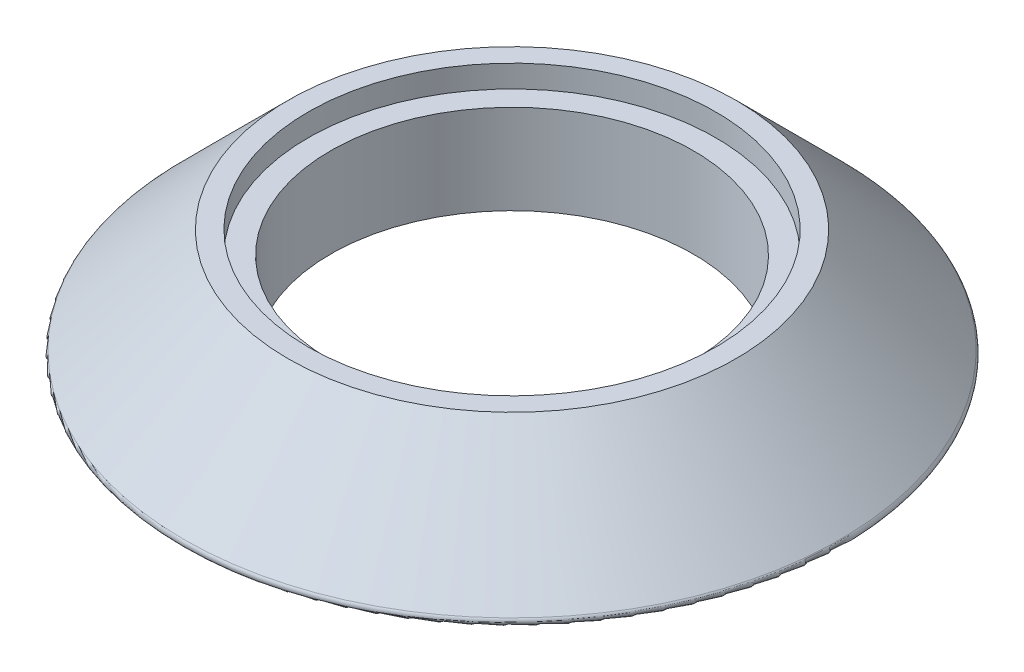
ISO-10303-21;
HEADER;
FILE_DESCRIPTION(('STEP AP214'),'2;1');
FILE_NAME('part.step','',(''),(''),'','','');
FILE_SCHEMA(('AUTOMOTIVE_DESIGN { 1 0 10303 214 1 1 1 1 }'));
ENDSEC;
DATA;
#1=APPLICATION_CONTEXT('core data for automotive mechanical design processes');
#2=APPLICATION_PROTOCOL_DEFINITION('international standard','automotive_design',2000,#1);
#3=PRODUCT_CONTEXT('',#1,'mechanical');
#4=PRODUCT('Part','Part','',(#3));
#5=PRODUCT_RELATED_PRODUCT_CATEGORY('part','',(#4));
#6=PRODUCT_DEFINITION_FORMATION('','',#4);
#7=PRODUCT_DEFINITION_CONTEXT('part definition',#1,'design');
#8=PRODUCT_DEFINITION('design','',#6,#7);
#9=PRODUCT_DEFINITION_SHAPE('','',#8);
#10=(LENGTH_UNIT() NAMED_UNIT(*) SI_UNIT(.MILLI.,.METRE.));
#11=(NAMED_UNIT(*) PLANE_ANGLE_UNIT() SI_UNIT($,.RADIAN.));
#12=(NAMED_UNIT(*) SI_UNIT($,.STERADIAN.) SOLID_ANGLE_UNIT());
#13=UNCERTAINTY_MEASURE_WITH_UNIT(LENGTH_MEASURE(1.E-05),#10,'distance_accuracy_value','');
#14=(GEOMETRIC_REPRESENTATION_CONTEXT(3) GLOBAL_UNCERTAINTY_ASSIGNED_CONTEXT((#13)) GLOBAL_UNIT_ASSIGNED_CONTEXT((#10,
#11,#12)) REPRESENTATION_CONTEXT('',''));
#15=CARTESIAN_POINT('',(0.,0.,0.));
#16=DIRECTION('',(0.,0.,1.));
#17=DIRECTION('',(1.,0.,0.));
#18=AXIS2_PLACEMENT_3D('',#15,#16,#17);
#19=CARTESIAN_POINT('',(0.,5.,0.));
#20=DIRECTION('',(0.,-1.,0.));
#21=DIRECTION('',(0.,0.,-1.));
#22=AXIS2_PLACEMENT_3D('',#19,#20,#21);
#23=CYLINDRICAL_SURFACE('',#22,8.1);
#24=CARTESIAN_POINT('',(0.,0.,0.));
#25=DIRECTION('',(0.,1.,0.));
#26=DIRECTION('',(0.,0.,1.));
#27=AXIS2_PLACEMENT_3D('',#24,#25,#26);
#28=CIRCLE('',#27,8.1);
#29=CARTESIAN_POINT('',(0.,0.,8.1));
#30=VERTEX_POINT('',#29);
#31=EDGE_CURVE('E42',#30,#30,#28,.T.);
#32=ORIENTED_EDGE('',*,*,#31,.F.);
#33=EDGE_LOOP('',(#32));
#34=FACE_BOUND('',#33,.T.);
#35=CARTESIAN_POINT('',(0.,4.,0.));
#36=DIRECTION('',(0.,1.,0.));
#37=DIRECTION('',(0.,0.,1.));
#38=AXIS2_PLACEMENT_3D('',#35,#36,#37);
#39=CIRCLE('',#38,8.1);
#40=CARTESIAN_POINT('',(0.,4.,8.1));
#41=VERTEX_POINT('',#40);
#42=EDGE_CURVE('E34',#41,#41,#39,.T.);
#43=ORIENTED_EDGE('',*,*,#42,.T.);
#44=EDGE_LOOP('',(#43));
#45=FACE_BOUND('',#44,.T.);
#46=ADVANCED_FACE('F30',(#34,#45),#23,.F.);
#47=CARTESIAN_POINT('',(0.,5.,0.));
#48=DIRECTION('',(0.,1.,0.));
#49=DIRECTION('',(0.,0.,1.));
#50=AXIS2_PLACEMENT_3D('',#47,#48,#49);
#51=PLANE('',#50);
#52=CARTESIAN_POINT('',(0.,5.,0.));
#53=DIRECTION('',(0.,1.,0.));
#54=DIRECTION('',(0.,0.,1.));
#55=AXIS2_PLACEMENT_3D('',#52,#53,#54);
#56=CIRCLE('',#55,9.1);
#57=CARTESIAN_POINT('',(0.,5.,9.1));
#58=VERTEX_POINT('',#57);
#59=EDGE_CURVE('E50',#58,#58,#56,.T.);
#60=ORIENTED_EDGE('',*,*,#59,.F.);
#61=EDGE_LOOP('',(#60));
#62=FACE_BOUND('',#61,.T.);
#63=CARTESIAN_POINT('',(0.,5.,0.));
#64=DIRECTION('',(0.,-1.,0.));
#65=DIRECTION('',(0.,0.,-1.));
#66=AXIS2_PLACEMENT_3D('',#63,#64,#65);
#67=CIRCLE('',#66,10.);
#68=CARTESIAN_POINT('',(0.,5.,-10.));
#69=VERTEX_POINT('',#68);
#70=EDGE_CURVE('E47',#69,#69,#67,.T.);
#71=ORIENTED_EDGE('',*,*,#70,.F.);
#72=EDGE_LOOP('',(#71));
#73=FACE_BOUND('',#72,.T.);
#74=ADVANCED_FACE('F71',(#62,#73),#51,.T.);
#75=CARTESIAN_POINT('',(0.,0.,0.));
#76=DIRECTION('',(0.,1.,0.));
#77=DIRECTION('',(0.,0.,1.));
#78=AXIS2_PLACEMENT_3D('',#75,#76,#77);
#79=PLANE('',#78);
#80=CARTESIAN_POINT('',(0.,0.,0.));
#81=DIRECTION('',(0.,1.,0.));
#82=DIRECTION('',(0.,0.,1.));
#83=AXIS2_PLACEMENT_3D('',#80,#81,#82);
#84=CIRCLE('',#83,14.5171572875254);
#85=CARTESIAN_POINT('',(0.,0.,14.5171572875254));
#86=VERTEX_POINT('',#85);
#87=EDGE_CURVE('E38',#86,#86,#84,.F.);
#88=ORIENTED_EDGE('',*,*,#87,.T.);
#89=EDGE_LOOP('',(#88));
#90=FACE_BOUND('',#89,.T.);
#91=ORIENTED_EDGE('',*,*,#31,.T.);
#92=EDGE_LOOP('',(#91));
#93=FACE_BOUND('',#92,.T.);
#94=ADVANCED_FACE('F77',(#90,#93),#79,.F.);
#95=CARTESIAN_POINT('',(0.,0.,0.));
#96=DIRECTION('',(0.,-1.,0.));
#97=DIRECTION('',(0.,0.,-1.));
#98=AXIS2_PLACEMENT_3D('',#95,#96,#97);
#99=CONICAL_SURFACE('',#98,15.,0.785398163397448);
#100=CARTESIAN_POINT('',(0.,0.34142135623731,0.));
#101=DIRECTION('',(0.,-1.,0.));
#102=DIRECTION('',(0.,0.,-1.));
#103=AXIS2_PLACEMENT_3D('',#100,#101,#102);
#104=CIRCLE('',#103,14.6585786437627);
#105=CARTESIAN_POINT('',(0.,0.34142135623731,-14.6585786437627));
#106=VERTEX_POINT('',#105);
#107=EDGE_CURVE('E10',#106,#106,#104,.F.);
#108=ORIENTED_EDGE('',*,*,#107,.T.);
#109=EDGE_LOOP('',(#108));
#110=FACE_BOUND('',#109,.T.);
#111=ORIENTED_EDGE('',*,*,#70,.T.);
#112=EDGE_LOOP('',(#111));
#113=FACE_BOUND('',#112,.T.);
#114=ADVANCED_FACE('F82',(#110,#113),#99,.T.);
#115=CARTESIAN_POINT('',(0.,0.2,0.));
#116=DIRECTION('',(0.,1.,0.));
#117=DIRECTION('',(0.,0.,1.));
#118=AXIS2_PLACEMENT_3D('',#115,#116,#117);
#119=TOROIDAL_SURFACE('',#118,14.5171572875254,0.2);
#120=ORIENTED_EDGE('',*,*,#107,.F.);
#121=EDGE_LOOP('',(#120));
#122=FACE_BOUND('',#121,.T.);
#123=ORIENTED_EDGE('',*,*,#87,.F.);
#124=EDGE_LOOP('',(#123));
#125=FACE_BOUND('',#124,.T.);
#126=ADVANCED_FACE('F32',(#122,#125),#119,.T.);
#127=CARTESIAN_POINT('',(0.,4.,0.));
#128=DIRECTION('',(0.,1.,0.));
#129=DIRECTION('',(0.,0.,1.));
#130=AXIS2_PLACEMENT_3D('',#127,#128,#129);
#131=CYLINDRICAL_SURFACE('',#130,9.1);
#132=CARTESIAN_POINT('',(0.,4.,0.));
#133=DIRECTION('',(0.,1.,0.));
#134=DIRECTION('',(0.,0.,1.));
#135=AXIS2_PLACEMENT_3D('',#132,#133,#134);
#136=CIRCLE('',#135,9.1);
#137=CARTESIAN_POINT('',(0.,4.,9.1));
#138=VERTEX_POINT('',#137);
#139=EDGE_CURVE('E53',#138,#138,#136,.T.);
#140=ORIENTED_EDGE('',*,*,#139,.F.);
#141=EDGE_LOOP('',(#140));
#142=FACE_BOUND('',#141,.T.);
#143=ORIENTED_EDGE('',*,*,#59,.T.);
#144=EDGE_LOOP('',(#143));
#145=FACE_BOUND('',#144,.T.);
#146=ADVANCED_FACE('F63',(#142,#145),#131,.F.);
#147=CARTESIAN_POINT('',(0.,4.,0.));
#148=DIRECTION('',(0.,1.,0.));
#149=DIRECTION('',(0.,0.,1.));
#150=AXIS2_PLACEMENT_3D('',#147,#148,#149);
#151=PLANE('',#150);
#152=ORIENTED_EDGE('',*,*,#42,.F.);
#153=EDGE_LOOP('',(#152));
#154=FACE_BOUND('',#153,.T.);
#155=ORIENTED_EDGE('',*,*,#139,.T.);
#156=EDGE_LOOP('',(#155));
#157=FACE_BOUND('',#156,.T.);
#158=ADVANCED_FACE('F61',(#154,#157),#151,.T.);
#159=CLOSED_SHELL('',(#46,#74,#94,#114,#126,#146,#158));
#160=MANIFOLD_SOLID_BREP('B2',#159);
#161=ADVANCED_BREP_SHAPE_REPRESENTATION('',(#18,#160),#14);
#162=SHAPE_DEFINITION_REPRESENTATION(#9,#161);
ENDSEC;
END-ISO-10303-21;
